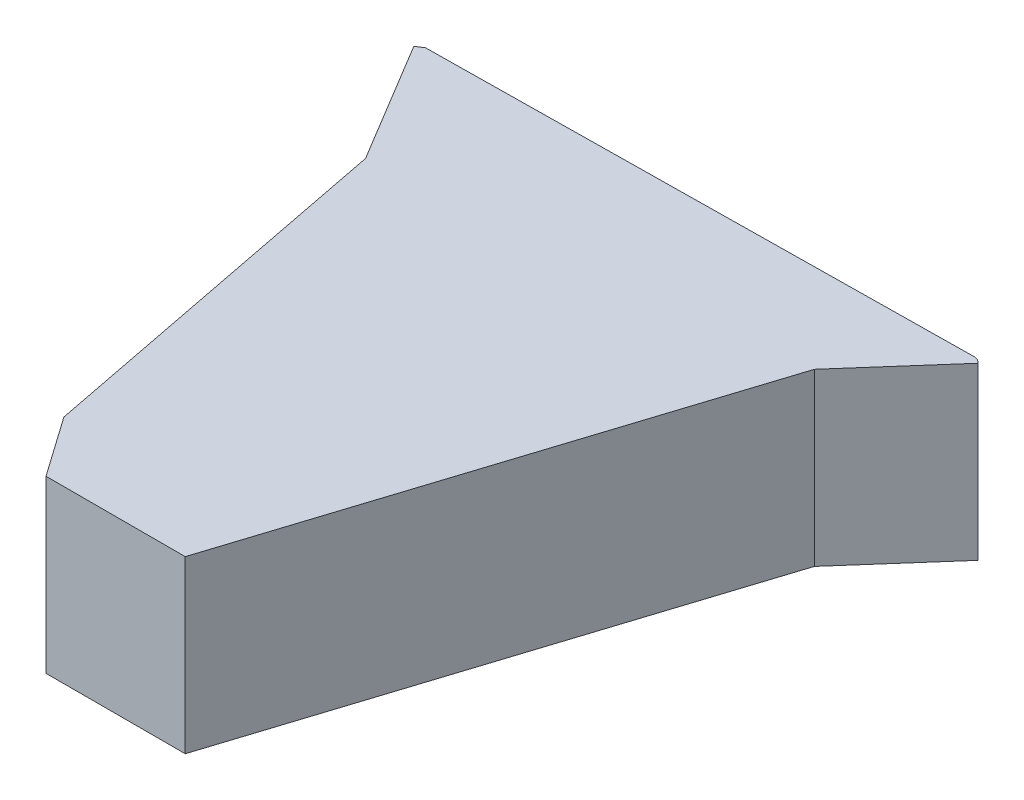
ISO-10303-21;
HEADER;
FILE_DESCRIPTION(('STEP AP214'),'2;1');
FILE_NAME('part.step','',(''),(''),'','','');
FILE_SCHEMA(('AUTOMOTIVE_DESIGN { 1 0 10303 214 1 1 1 1 }'));
ENDSEC;
DATA;
#1=APPLICATION_CONTEXT('core data for automotive mechanical design processes');
#2=APPLICATION_PROTOCOL_DEFINITION('international standard','automotive_design',2000,#1);
#3=PRODUCT_CONTEXT('',#1,'mechanical');
#4=PRODUCT('Part','Part','',(#3));
#5=PRODUCT_RELATED_PRODUCT_CATEGORY('part','',(#4));
#6=PRODUCT_DEFINITION_FORMATION('','',#4);
#7=PRODUCT_DEFINITION_CONTEXT('part definition',#1,'design');
#8=PRODUCT_DEFINITION('design','',#6,#7);
#9=PRODUCT_DEFINITION_SHAPE('','',#8);
#10=(LENGTH_UNIT() NAMED_UNIT(*) SI_UNIT(.MILLI.,.METRE.));
#11=(NAMED_UNIT(*) PLANE_ANGLE_UNIT() SI_UNIT($,.RADIAN.));
#12=(NAMED_UNIT(*) SI_UNIT($,.STERADIAN.) SOLID_ANGLE_UNIT());
#13=UNCERTAINTY_MEASURE_WITH_UNIT(LENGTH_MEASURE(1.E-05),#10,'distance_accuracy_value','');
#14=(GEOMETRIC_REPRESENTATION_CONTEXT(3) GLOBAL_UNCERTAINTY_ASSIGNED_CONTEXT((#13)) GLOBAL_UNIT_ASSIGNED_CONTEXT((#10,
#11,#12)) REPRESENTATION_CONTEXT('',''));
#15=CARTESIAN_POINT('',(0.,0.,0.));
#16=DIRECTION('',(0.,0.,1.));
#17=DIRECTION('',(1.,0.,0.));
#18=AXIS2_PLACEMENT_3D('',#15,#16,#17);
#19=CARTESIAN_POINT('',(0.,80.,0.));
#20=DIRECTION('',(0.,1.,0.));
#21=DIRECTION('',(0.,0.,1.));
#22=AXIS2_PLACEMENT_3D('',#19,#20,#21);
#23=PLANE('',#22);
#24=DIRECTION('',(-0.660248700533118,0.,0.751047038103692));
#25=VECTOR('',#24,1.);
#26=CARTESIAN_POINT('',(46.6502368151546,80.,-274.975459977963));
#27=LINE('',#26,#25);
#28=CARTESIAN_POINT('',(83.7031156426736,80.,-317.123903245104));
#29=VERTEX_POINT('',#28);
#30=CARTESIAN_POINT('',(46.6502368151546,80.,-274.975459977963));
#31=VERTEX_POINT('',#30);
#32=EDGE_CURVE('E234',#29,#31,#27,.T.);
#33=ORIENTED_EDGE('',*,*,#32,.T.);
#34=DIRECTION('',(-0.304316684641277,0.,0.952570918855358));
#35=VECTOR('',#34,1.);
#36=CARTESIAN_POINT('',(-26.188648694374,80.,-46.9754599779608));
#37=LINE('',#36,#35);
#38=CARTESIAN_POINT('',(-26.188648694374,80.,-46.9754599779608));
#39=VERTEX_POINT('',#38);
#40=EDGE_CURVE('E237',#31,#39,#37,.T.);
#41=ORIENTED_EDGE('',*,*,#40,.T.);
#42=DIRECTION('',(-1.,0.,0.));
#43=VECTOR('',#42,1.);
#44=CARTESIAN_POINT('',(-26.188648694374,80.,-46.9754599779608));
#45=LINE('',#44,#43);
#46=CARTESIAN_POINT('',(-90.5581250943112,80.,-46.9754599779625));
#47=VERTEX_POINT('',#46);
#48=EDGE_CURVE('E241',#39,#47,#45,.T.);
#49=ORIENTED_EDGE('',*,*,#48,.T.);
#50=DIRECTION('',(-0.574979090419619,0.,-0.818168103497214));
#51=VECTOR('',#50,1.);
#52=CARTESIAN_POINT('',(-110.045954214974,80.,-74.7057208841369));
#53=LINE('',#52,#51);
#54=CARTESIAN_POINT('',(-110.045954214974,80.,-74.7057208841369));
#55=VERTEX_POINT('',#54);
#56=EDGE_CURVE('E244',#47,#55,#53,.T.);
#57=ORIENTED_EDGE('',*,*,#56,.T.);
#58=DIRECTION('',(-0.191458843739684,0.,-0.981500642462277));
#59=VECTOR('',#58,1.);
#60=CARTESIAN_POINT('',(-110.045954214974,80.,-74.7057208841369));
#61=LINE('',#60,#59);
#62=CARTESIAN_POINT('',(-145.137395051597,80.,-254.599587645919));
#63=VERTEX_POINT('',#62);
#64=EDGE_CURVE('E247',#55,#63,#61,.T.);
#65=ORIENTED_EDGE('',*,*,#64,.T.);
#66=DIRECTION('',(-0.515605453055569,0.,-0.856826129841616));
#67=VECTOR('',#66,1.);
#68=CARTESIAN_POINT('',(-180.407965552068,80.,-313.211742036706));
#69=LINE('',#68,#67);
#70=CARTESIAN_POINT('',(-180.407965552068,80.,-313.211742036706));
#71=VERTEX_POINT('',#70);
#72=EDGE_CURVE('E250',#63,#71,#69,.T.);
#73=ORIENTED_EDGE('',*,*,#72,.T.);
#74=DIRECTION('',(-0.830644318798817,0.,0.556803390477509));
#75=VECTOR('',#74,1.);
#76=CARTESIAN_POINT('',(-180.407965552068,80.,-313.211742036706));
#77=LINE('',#76,#75);
#78=CARTESIAN_POINT('',(-178.74667691447,80.,-314.325348817661));
#79=VERTEX_POINT('',#78);
#80=EDGE_CURVE('E307',#79,#71,#77,.T.);
#81=ORIENTED_EDGE('',*,*,#80,.F.);
#82=DIRECTION('',(-0.999920335389979,0.,0.0126223164906736));
#83=VECTOR('',#82,1.);
#84=CARTESIAN_POINT('',(-178.74667691447,80.,-314.325348817661));
#85=LINE('',#84,#83);
#86=CARTESIAN_POINT('',(81.7640584939281,80.,-317.613859747144));
#87=VERTEX_POINT('',#86);
#88=EDGE_CURVE('E312',#87,#79,#85,.T.);
#89=ORIENTED_EDGE('',*,*,#88,.F.);
#90=DIRECTION('',(-0.969528574373599,0.,-0.244978251020569));
#91=VECTOR('',#90,1.);
#92=CARTESIAN_POINT('',(81.7640584939281,80.,-317.613859747144));
#93=LINE('',#92,#91);
#94=EDGE_CURVE('E335',#29,#87,#93,.T.);
#95=ORIENTED_EDGE('',*,*,#94,.F.);
#96=EDGE_LOOP('',(#33,#41,#49,#57,#65,#73,#81,#89,#95));
#97=FACE_BOUND('',#96,.T.);
#98=CARTESIAN_POINT('',(-100.003600919709,80.,-94.2573460686679));
#99=DIRECTION('',(0.,1.,0.));
#100=DIRECTION('',(0.,0.,1.));
#101=AXIS2_PLACEMENT_3D('',#98,#99,#100);
#102=CIRCLE('',#101,8.99999999999999);
#103=CARTESIAN_POINT('',(-100.003600919709,80.,-85.2573460686679));
#104=VERTEX_POINT('',#103);
#105=EDGE_CURVE('E11',#104,#104,#102,.T.);
#106=ORIENTED_EDGE('',*,*,#105,.T.);
#107=EDGE_LOOP('',(#106));
#108=FACE_BOUND('',#107,.T.);
#109=DIRECTION('',(-0.866025403784438,0.,-0.5));
#110=VECTOR('',#109,1.);
#111=CARTESIAN_POINT('',(-11.059034150561,80.,-169.98673388868));
#112=LINE('',#111,#110);
#113=CARTESIAN_POINT('',(-11.059034150561,80.,-169.98673388868));
#114=VERTEX_POINT('',#113);
#115=CARTESIAN_POINT('',(-51.6700330731528,80.,-193.433505048698));
#116=VERTEX_POINT('',#115);
#117=EDGE_CURVE('E48',#114,#116,#112,.T.);
#118=ORIENTED_EDGE('',*,*,#117,.T.);
#119=DIRECTION('',(-0.866025403784439,0.,0.5));
#120=VECTOR('',#119,1.);
#121=CARTESIAN_POINT('',(-51.6700330731528,80.,-193.433505048698));
#122=LINE('',#121,#120);
#123=CARTESIAN_POINT('',(-92.2810319957446,80.,-169.98673388868));
#124=VERTEX_POINT('',#123);
#125=EDGE_CURVE('E52',#116,#124,#122,.T.);
#126=ORIENTED_EDGE('',*,*,#125,.T.);
#127=DIRECTION('',(0.,0.,1.));
#128=VECTOR('',#127,1.);
#129=CARTESIAN_POINT('',(-92.2810319957446,80.,-169.98673388868));
#130=LINE('',#129,#128);
#131=CARTESIAN_POINT('',(-92.2810319957446,80.,-123.093191568644));
#132=VERTEX_POINT('',#131);
#133=EDGE_CURVE('E677',#124,#132,#130,.T.);
#134=ORIENTED_EDGE('',*,*,#133,.T.);
#135=DIRECTION('',(0.866025403784439,0.,0.5));
#136=VECTOR('',#135,1.);
#137=CARTESIAN_POINT('',(-92.2810319957446,80.,-123.093191568644));
#138=LINE('',#137,#136);
#139=CARTESIAN_POINT('',(-51.6700330731528,80.,-99.6464204086263));
#140=VERTEX_POINT('',#139);
#141=EDGE_CURVE('E190',#132,#140,#138,.T.);
#142=ORIENTED_EDGE('',*,*,#141,.T.);
#143=DIRECTION('',(0.866025403784438,0.,-0.5));
#144=VECTOR('',#143,1.);
#145=CARTESIAN_POINT('',(-51.6700330731528,80.,-99.6464204086263));
#146=LINE('',#145,#144);
#147=CARTESIAN_POINT('',(-11.059034150561,80.,-123.093191568644));
#148=VERTEX_POINT('',#147);
#149=EDGE_CURVE('E184',#140,#148,#146,.T.);
#150=ORIENTED_EDGE('',*,*,#149,.T.);
#151=DIRECTION('',(0.,0.,-1.));
#152=VECTOR('',#151,1.);
#153=CARTESIAN_POINT('',(-11.059034150561,80.,-123.093191568644));
#154=LINE('',#153,#152);
#155=EDGE_CURVE('E187',#148,#114,#154,.T.);
#156=ORIENTED_EDGE('',*,*,#155,.T.);
#157=EDGE_LOOP('',(#118,#126,#134,#142,#150,#156));
#158=FACE_BOUND('',#157,.T.);
#159=ADVANCED_FACE('F33',(#97,#108,#158),#23,.F.);
#160=CARTESIAN_POINT('',(-100.003600919709,80.,-94.2573460686679));
#161=DIRECTION('',(0.,-1.,0.));
#162=DIRECTION('',(0.,0.,-1.));
#163=AXIS2_PLACEMENT_3D('',#160,#161,#162);
#164=CYLINDRICAL_SURFACE('',#163,8.99999999999999);
#165=ORIENTED_EDGE('',*,*,#105,.F.);
#166=EDGE_LOOP('',(#165));
#167=FACE_BOUND('',#166,.T.);
#168=CARTESIAN_POINT('',(-100.003600919709,0.,-94.2573460686679));
#169=DIRECTION('',(0.,1.,0.));
#170=DIRECTION('',(0.,0.,1.));
#171=AXIS2_PLACEMENT_3D('',#168,#169,#170);
#172=CIRCLE('',#171,8.99999999999999);
#173=CARTESIAN_POINT('',(-100.003600919709,0.,-85.2573460686679));
#174=VERTEX_POINT('',#173);
#175=EDGE_CURVE('E37',#174,#174,#172,.T.);
#176=ORIENTED_EDGE('',*,*,#175,.T.);
#177=EDGE_LOOP('',(#176));
#178=FACE_BOUND('',#177,.T.);
#179=ADVANCED_FACE('F35',(#167,#178),#164,.T.);
#180=CARTESIAN_POINT('',(-100.003600919709,0.,-94.2573460686679));
#181=DIRECTION('',(0.,1.,0.));
#182=DIRECTION('',(0.,0.,1.));
#183=AXIS2_PLACEMENT_3D('',#180,#181,#182);
#184=PLANE('',#183);
#185=ORIENTED_EDGE('',*,*,#175,.F.);
#186=EDGE_LOOP('',(#185));
#187=FACE_BOUND('',#186,.T.);
#188=ADVANCED_FACE('F368',(#187),#184,.F.);
#189=CARTESIAN_POINT('',(-180.407965552068,82.,-313.211742036706));
#190=DIRECTION('',(0.556803390477509,0.,0.830644318798817));
#191=DIRECTION('',(0.830644318798817,0.,-0.556803390477509));
#192=AXIS2_PLACEMENT_3D('',#189,#190,#191);
#193=PLANE('',#192);
#194=ORIENTED_EDGE('',*,*,#80,.T.);
#195=DIRECTION('',(0.,-1.,0.));
#196=VECTOR('',#195,1.);
#197=CARTESIAN_POINT('',(-180.407965552068,82.,-313.211742036706));
#198=LINE('',#197,#196);
#199=CARTESIAN_POINT('',(-180.407965552068,82.,-313.211742036706));
#200=VERTEX_POINT('',#199);
#201=EDGE_CURVE('E360',#200,#71,#198,.T.);
#202=ORIENTED_EDGE('',*,*,#201,.F.);
#203=DIRECTION('',(-0.830644318798817,0.,0.556803390477509));
#204=VECTOR('',#203,1.);
#205=CARTESIAN_POINT('',(-180.407965552068,82.,-313.211742036706));
#206=LINE('',#205,#204);
#207=CARTESIAN_POINT('',(-178.74667691447,82.,-314.325348817661));
#208=VERTEX_POINT('',#207);
#209=EDGE_CURVE('E308',#208,#200,#206,.T.);
#210=ORIENTED_EDGE('',*,*,#209,.F.);
#211=DIRECTION('',(0.,-1.,0.));
#212=VECTOR('',#211,1.);
#213=CARTESIAN_POINT('',(-178.74667691447,82.,-314.325348817661));
#214=LINE('',#213,#212);
#215=EDGE_CURVE('E332',#208,#79,#214,.T.);
#216=ORIENTED_EDGE('',*,*,#215,.T.);
#217=EDGE_LOOP('',(#194,#202,#210,#216));
#218=FACE_BOUND('',#217,.T.);
#219=ADVANCED_FACE('F370',(#218),#193,.F.);
#220=CARTESIAN_POINT('',(-180.407965552068,82.,-313.211742036706));
#221=DIRECTION('',(0.515605453055568,0.,0.856826129841616));
#222=DIRECTION('',(0.856826129841616,0.,-0.515605453055568));
#223=AXIS2_PLACEMENT_3D('',#220,#221,#222);
#224=PLANE('',#223);
#225=ORIENTED_EDGE('',*,*,#201,.T.);
#226=DIRECTION('',(0.,-1.,0.));
#227=VECTOR('',#226,1.);
#228=CARTESIAN_POINT('',(-180.407965552068,80.,-313.211742036706));
#229=LINE('',#228,#227);
#230=CARTESIAN_POINT('',(-180.407965552068,0.,-313.211742036706));
#231=VERTEX_POINT('',#230);
#232=EDGE_CURVE('E253',#71,#231,#229,.T.);
#233=ORIENTED_EDGE('',*,*,#232,.T.);
#234=DIRECTION('',(-0.856826129841616,0.,0.515605453055568));
#235=VECTOR('',#234,1.);
#236=CARTESIAN_POINT('',(-182.121617811751,0.,-312.180531130594));
#237=LINE('',#236,#235);
#238=CARTESIAN_POINT('',(-182.121617811751,0.,-312.180531130594));
#239=VERTEX_POINT('',#238);
#240=EDGE_CURVE('E233',#231,#239,#237,.T.);
#241=ORIENTED_EDGE('',*,*,#240,.T.);
#242=DIRECTION('',(0.,-1.,0.));
#243=VECTOR('',#242,1.);
#244=CARTESIAN_POINT('',(-182.121617811751,82.,-312.180531130594));
#245=LINE('',#244,#243);
#246=CARTESIAN_POINT('',(-182.121617811751,82.,-312.180531130594));
#247=VERTEX_POINT('',#246);
#248=EDGE_CURVE('E358',#247,#239,#245,.T.);
#249=ORIENTED_EDGE('',*,*,#248,.F.);
#250=DIRECTION('',(-0.856826129841616,0.,0.515605453055568));
#251=VECTOR('',#250,1.);
#252=CARTESIAN_POINT('',(-180.407965552068,82.,-313.211742036706));
#253=LINE('',#252,#251);
#254=EDGE_CURVE('E311',#200,#247,#253,.T.);
#255=ORIENTED_EDGE('',*,*,#254,.F.);
#256=EDGE_LOOP('',(#225,#233,#241,#249,#255));
#257=FACE_BOUND('',#256,.T.);
#258=ADVANCED_FACE('F375',(#257),#224,.F.);
#259=CARTESIAN_POINT('',(-182.121617811751,82.,-312.180531130594));
#260=DIRECTION('',(0.856826129841616,0.,-0.515605453055569));
#261=DIRECTION('',(-0.515605453055569,0.,-0.856826129841616));
#262=AXIS2_PLACEMENT_3D('',#259,#260,#261);
#263=PLANE('',#262);
#264=ORIENTED_EDGE('',*,*,#248,.T.);
#265=DIRECTION('',(0.515605453055569,0.,0.856826129841616));
#266=VECTOR('',#265,1.);
#267=CARTESIAN_POINT('',(-147.032877616828,0.,-253.870539868742));
#268=LINE('',#267,#266);
#269=CARTESIAN_POINT('',(-147.032877616828,0.,-253.870539868742));
#270=VERTEX_POINT('',#269);
#271=EDGE_CURVE('E256',#239,#270,#268,.T.);
#272=ORIENTED_EDGE('',*,*,#271,.T.);
#273=DIRECTION('',(0.,-1.,0.));
#274=VECTOR('',#273,1.);
#275=CARTESIAN_POINT('',(-147.032877616828,82.,-253.870539868742));
#276=LINE('',#275,#274);
#277=CARTESIAN_POINT('',(-147.032877616828,82.,-253.870539868742));
#278=VERTEX_POINT('',#277);
#279=EDGE_CURVE('E356',#278,#270,#276,.T.);
#280=ORIENTED_EDGE('',*,*,#279,.F.);
#281=DIRECTION('',(0.515605453055569,0.,0.856826129841616));
#282=VECTOR('',#281,1.);
#283=CARTESIAN_POINT('',(-182.121617811751,82.,-312.180531130594));
#284=LINE('',#283,#282);
#285=EDGE_CURVE('E314',#247,#278,#284,.T.);
#286=ORIENTED_EDGE('',*,*,#285,.F.);
#287=EDGE_LOOP('',(#264,#272,#280,#286));
#288=FACE_BOUND('',#287,.T.);
#289=ADVANCED_FACE('F420',(#288),#263,.F.);
#290=CARTESIAN_POINT('',(-147.032877616828,82.,-253.870539868742));
#291=DIRECTION('',(0.981500642462277,0.,-0.191458843739684));
#292=DIRECTION('',(-0.191458843739684,0.,-0.981500642462278));
#293=AXIS2_PLACEMENT_3D('',#290,#291,#292);
#294=PLANE('',#293);
#295=ORIENTED_EDGE('',*,*,#279,.T.);
#296=DIRECTION('',(0.191458843739684,0.,0.981500642462277));
#297=VECTOR('',#296,1.);
#298=CARTESIAN_POINT('',(-147.032877616828,0.,-253.870539868742));
#299=LINE('',#298,#297);
#300=CARTESIAN_POINT('',(-111.927353434914,0.,-73.9044758023983));
#301=VERTEX_POINT('',#300);
#302=EDGE_CURVE('E259',#270,#301,#299,.T.);
#303=ORIENTED_EDGE('',*,*,#302,.T.);
#304=DIRECTION('',(0.,-1.,0.));
#305=VECTOR('',#304,1.);
#306=CARTESIAN_POINT('',(-111.927353434914,82.,-73.9044758023983));
#307=LINE('',#306,#305);
#308=CARTESIAN_POINT('',(-111.927353434914,82.,-73.9044758023983));
#309=VERTEX_POINT('',#308);
#310=EDGE_CURVE('E354',#309,#301,#307,.T.);
#311=ORIENTED_EDGE('',*,*,#310,.F.);
#312=DIRECTION('',(0.191458843739684,0.,0.981500642462277));
#313=VECTOR('',#312,1.);
#314=CARTESIAN_POINT('',(-147.032877616828,82.,-253.870539868742));
#315=LINE('',#314,#313);
#316=EDGE_CURVE('E316',#278,#309,#315,.T.);
#317=ORIENTED_EDGE('',*,*,#316,.F.);
#318=EDGE_LOOP('',(#295,#303,#311,#317));
#319=FACE_BOUND('',#318,.T.);
#320=ADVANCED_FACE('F416',(#319),#294,.F.);
#321=CARTESIAN_POINT('',(-91.5970825109194,82.,-44.9754599779625));
#322=DIRECTION('',(0.818168103497214,0.,-0.574979090419619));
#323=DIRECTION('',(-0.574979090419619,0.,-0.818168103497214));
#324=AXIS2_PLACEMENT_3D('',#321,#322,#323);
#325=PLANE('',#324);
#326=ORIENTED_EDGE('',*,*,#310,.T.);
#327=DIRECTION('',(0.574979090419619,0.,0.818168103497213));
#328=VECTOR('',#327,1.);
#329=CARTESIAN_POINT('',(-111.927353434914,0.,-73.9044758023983));
#330=LINE('',#329,#328);
#331=CARTESIAN_POINT('',(-91.5970825109194,0.,-44.9754599779625));
#332=VERTEX_POINT('',#331);
#333=EDGE_CURVE('E262',#301,#332,#330,.T.);
#334=ORIENTED_EDGE('',*,*,#333,.T.);
#335=DIRECTION('',(0.,-1.,0.));
#336=VECTOR('',#335,1.);
#337=CARTESIAN_POINT('',(-91.5970825109194,82.,-44.9754599779625));
#338=LINE('',#337,#336);
#339=CARTESIAN_POINT('',(-91.5970825109194,82.,-44.9754599779625));
#340=VERTEX_POINT('',#339);
#341=EDGE_CURVE('E352',#340,#332,#338,.T.);
#342=ORIENTED_EDGE('',*,*,#341,.F.);
#343=DIRECTION('',(0.574979090419619,0.,0.818168103497213));
#344=VECTOR('',#343,1.);
#345=CARTESIAN_POINT('',(-91.5970825109194,82.,-44.9754599779625));
#346=LINE('',#345,#344);
#347=EDGE_CURVE('E318',#309,#340,#346,.T.);
#348=ORIENTED_EDGE('',*,*,#347,.F.);
#349=EDGE_LOOP('',(#326,#334,#342,#348));
#350=FACE_BOUND('',#349,.T.);
#351=ADVANCED_FACE('F412',(#350),#325,.F.);
#352=CARTESIAN_POINT('',(-91.5970825109194,82.,-44.9754599779625));
#353=DIRECTION('',(0.,0.,-1.));
#354=DIRECTION('',(-1.,0.,0.));
#355=AXIS2_PLACEMENT_3D('',#352,#353,#354);
#356=PLANE('',#355);
#357=ORIENTED_EDGE('',*,*,#341,.T.);
#358=DIRECTION('',(1.,0.,0.));
#359=VECTOR('',#358,1.);
#360=CARTESIAN_POINT('',(-91.5970825109194,0.,-44.9754599779625));
#361=LINE('',#360,#359);
#362=CARTESIAN_POINT('',(-24.7280050791047,0.,-44.9754599779607));
#363=VERTEX_POINT('',#362);
#364=EDGE_CURVE('E265',#332,#363,#361,.T.);
#365=ORIENTED_EDGE('',*,*,#364,.T.);
#366=DIRECTION('',(0.,-1.,0.));
#367=VECTOR('',#366,1.);
#368=CARTESIAN_POINT('',(-24.7280050791047,82.,-44.9754599779607));
#369=LINE('',#368,#367);
#370=CARTESIAN_POINT('',(-24.7280050791047,82.,-44.9754599779607));
#371=VERTEX_POINT('',#370);
#372=EDGE_CURVE('E350',#371,#363,#369,.T.);
#373=ORIENTED_EDGE('',*,*,#372,.F.);
#374=DIRECTION('',(1.,0.,0.));
#375=VECTOR('',#374,1.);
#376=CARTESIAN_POINT('',(-91.5970825109194,82.,-44.9754599779625));
#377=LINE('',#376,#375);
#378=EDGE_CURVE('E320',#340,#371,#377,.T.);
#379=ORIENTED_EDGE('',*,*,#378,.F.);
#380=EDGE_LOOP('',(#357,#365,#373,#379));
#381=FACE_BOUND('',#380,.T.);
#382=ADVANCED_FACE('F408',(#381),#356,.F.);
#383=CARTESIAN_POINT('',(-24.7280050791047,82.,-44.9754599779607));
#384=DIRECTION('',(-0.952570918855358,0.,-0.304316684641277));
#385=DIRECTION('',(-0.304316684641277,0.,0.952570918855358));
#386=AXIS2_PLACEMENT_3D('',#383,#384,#385);
#387=PLANE('',#386);
#388=ORIENTED_EDGE('',*,*,#372,.T.);
#389=DIRECTION('',(0.304316684641277,0.,-0.952570918855358));
#390=VECTOR('',#389,1.);
#391=CARTESIAN_POINT('',(48.4282186278252,0.,-273.968790786107));
#392=LINE('',#391,#390);
#393=CARTESIAN_POINT('',(48.4282186278252,0.,-273.968790786107));
#394=VERTEX_POINT('',#393);
#395=EDGE_CURVE('E268',#363,#394,#392,.T.);
#396=ORIENTED_EDGE('',*,*,#395,.T.);
#397=DIRECTION('',(0.,-1.,0.));
#398=VECTOR('',#397,1.);
#399=CARTESIAN_POINT('',(48.4282186278252,82.,-273.968790786107));
#400=LINE('',#399,#398);
#401=CARTESIAN_POINT('',(48.4282186278252,82.,-273.968790786107));
#402=VERTEX_POINT('',#401);
#403=EDGE_CURVE('E348',#402,#394,#400,.T.);
#404=ORIENTED_EDGE('',*,*,#403,.F.);
#405=DIRECTION('',(0.304316684641277,0.,-0.952570918855358));
#406=VECTOR('',#405,1.);
#407=CARTESIAN_POINT('',(-24.7280050791047,82.,-44.9754599779607));
#408=LINE('',#407,#406);
#409=EDGE_CURVE('E322',#371,#402,#408,.T.);
#410=ORIENTED_EDGE('',*,*,#409,.F.);
#411=EDGE_LOOP('',(#388,#396,#404,#410));
#412=FACE_BOUND('',#411,.T.);
#413=ADVANCED_FACE('F404',(#412),#387,.F.);
#414=CARTESIAN_POINT('',(48.4282186278252,82.,-273.968790786107));
#415=DIRECTION('',(-0.751047038103692,0.,-0.660248700533119));
#416=DIRECTION('',(-0.660248700533119,0.,0.751047038103692));
#417=AXIS2_PLACEMENT_3D('',#414,#415,#416);
#418=PLANE('',#417);
#419=ORIENTED_EDGE('',*,*,#403,.T.);
#420=DIRECTION('',(0.660248700533119,0.,-0.751047038103692));
#421=VECTOR('',#420,1.);
#422=CARTESIAN_POINT('',(85.2052097188798,0.,-315.803405844038));
#423=LINE('',#422,#421);
#424=CARTESIAN_POINT('',(85.2052097188798,0.,-315.803405844038));
#425=VERTEX_POINT('',#424);
#426=EDGE_CURVE('E271',#394,#425,#423,.T.);
#427=ORIENTED_EDGE('',*,*,#426,.T.);
#428=DIRECTION('',(0.,-1.,0.));
#429=VECTOR('',#428,1.);
#430=CARTESIAN_POINT('',(85.2052097188798,82.,-315.803405844038));
#431=LINE('',#430,#429);
#432=CARTESIAN_POINT('',(85.2052097188798,82.,-315.803405844038));
#433=VERTEX_POINT('',#432);
#434=EDGE_CURVE('E346',#433,#425,#431,.T.);
#435=ORIENTED_EDGE('',*,*,#434,.F.);
#436=DIRECTION('',(0.660248700533119,0.,-0.751047038103692));
#437=VECTOR('',#436,1.);
#438=CARTESIAN_POINT('',(48.4282186278252,82.,-273.968790786107));
#439=LINE('',#438,#437);
#440=EDGE_CURVE('E324',#402,#433,#439,.T.);
#441=ORIENTED_EDGE('',*,*,#440,.F.);
#442=EDGE_LOOP('',(#419,#427,#435,#441));
#443=FACE_BOUND('',#442,.T.);
#444=ADVANCED_FACE('F400',(#443),#418,.F.);
#445=CARTESIAN_POINT('',(85.2052097188798,82.,-315.803405844038));
#446=DIRECTION('',(-0.660248700533117,0.,0.751047038103693));
#447=DIRECTION('',(0.751047038103693,0.,0.660248700533117));
#448=AXIS2_PLACEMENT_3D('',#445,#446,#447);
#449=PLANE('',#448);
#450=ORIENTED_EDGE('',*,*,#434,.T.);
#451=DIRECTION('',(-0.751047038103693,0.,-0.660248700533117));
#452=VECTOR('',#451,1.);
#453=CARTESIAN_POINT('',(83.7031156426736,0.,-317.123903245104));
#454=LINE('',#453,#452);
#455=CARTESIAN_POINT('',(83.7031156426736,0.,-317.123903245104));
#456=VERTEX_POINT('',#455);
#457=EDGE_CURVE('E274',#425,#456,#454,.T.);
#458=ORIENTED_EDGE('',*,*,#457,.T.);
#459=DIRECTION('',(0.,-1.,0.));
#460=VECTOR('',#459,1.);
#461=CARTESIAN_POINT('',(83.7031156426736,80.,-317.123903245104));
#462=LINE('',#461,#460);
#463=EDGE_CURVE('E304',#29,#456,#462,.T.);
#464=ORIENTED_EDGE('',*,*,#463,.F.);
#465=DIRECTION('',(0.,-1.,0.));
#466=VECTOR('',#465,1.);
#467=CARTESIAN_POINT('',(83.7031156426736,82.,-317.123903245104));
#468=LINE('',#467,#466);
#469=CARTESIAN_POINT('',(83.7031156426736,82.,-317.123903245104));
#470=VERTEX_POINT('',#469);
#471=EDGE_CURVE('E343',#470,#29,#468,.T.);
#472=ORIENTED_EDGE('',*,*,#471,.F.);
#473=DIRECTION('',(-0.751047038103693,0.,-0.660248700533117));
#474=VECTOR('',#473,1.);
#475=CARTESIAN_POINT('',(85.2052097188798,82.,-315.803405844038));
#476=LINE('',#475,#474);
#477=EDGE_CURVE('E326',#433,#470,#476,.T.);
#478=ORIENTED_EDGE('',*,*,#477,.F.);
#479=EDGE_LOOP('',(#450,#458,#464,#472,#478));
#480=FACE_BOUND('',#479,.T.);
#481=ADVANCED_FACE('F396',(#480),#449,.F.);
#482=CARTESIAN_POINT('',(81.7640584939281,82.,-317.613859747144));
#483=DIRECTION('',(-0.244978251020569,0.,0.969528574373599));
#484=DIRECTION('',(0.969528574373599,0.,0.244978251020569));
#485=AXIS2_PLACEMENT_3D('',#482,#483,#484);
#486=PLANE('',#485);
#487=ORIENTED_EDGE('',*,*,#94,.T.);
#488=DIRECTION('',(0.,-1.,0.));
#489=VECTOR('',#488,1.);
#490=CARTESIAN_POINT('',(81.7640584939281,82.,-317.613859747144));
#491=LINE('',#490,#489);
#492=CARTESIAN_POINT('',(81.7640584939281,82.,-317.613859747144));
#493=VERTEX_POINT('',#492);
#494=EDGE_CURVE('E340',#493,#87,#491,.T.);
#495=ORIENTED_EDGE('',*,*,#494,.F.);
#496=DIRECTION('',(-0.969528574373599,0.,-0.244978251020569));
#497=VECTOR('',#496,1.);
#498=CARTESIAN_POINT('',(81.7640584939281,82.,-317.613859747144));
#499=LINE('',#498,#497);
#500=EDGE_CURVE('E328',#470,#493,#499,.T.);
#501=ORIENTED_EDGE('',*,*,#500,.F.);
#502=ORIENTED_EDGE('',*,*,#471,.T.);
#503=EDGE_LOOP('',(#487,#495,#501,#502));
#504=FACE_BOUND('',#503,.T.);
#505=ADVANCED_FACE('F392',(#504),#486,.F.);
#506=CARTESIAN_POINT('',(-178.74667691447,82.,-314.325348817661));
#507=DIRECTION('',(0.0126223164906736,0.,0.99992033538998));
#508=DIRECTION('',(0.99992033538998,0.,-0.0126223164906736));
#509=AXIS2_PLACEMENT_3D('',#506,#507,#508);
#510=PLANE('',#509);
#511=ORIENTED_EDGE('',*,*,#88,.T.);
#512=ORIENTED_EDGE('',*,*,#215,.F.);
#513=DIRECTION('',(-0.999920335389979,0.,0.0126223164906736));
#514=VECTOR('',#513,1.);
#515=CARTESIAN_POINT('',(-178.74667691447,82.,-314.325348817661));
#516=LINE('',#515,#514);
#517=EDGE_CURVE('E330',#493,#208,#516,.T.);
#518=ORIENTED_EDGE('',*,*,#517,.F.);
#519=ORIENTED_EDGE('',*,*,#494,.T.);
#520=EDGE_LOOP('',(#511,#512,#518,#519));
#521=FACE_BOUND('',#520,.T.);
#522=ADVANCED_FACE('F389',(#521),#510,.F.);
#523=CARTESIAN_POINT('',(0.,82.,0.));
#524=DIRECTION('',(0.,1.,0.));
#525=DIRECTION('',(0.,0.,1.));
#526=AXIS2_PLACEMENT_3D('',#523,#524,#525);
#527=PLANE('',#526);
#528=ORIENTED_EDGE('',*,*,#209,.T.);
#529=ORIENTED_EDGE('',*,*,#254,.T.);
#530=ORIENTED_EDGE('',*,*,#285,.T.);
#531=ORIENTED_EDGE('',*,*,#316,.T.);
#532=ORIENTED_EDGE('',*,*,#347,.T.);
#533=ORIENTED_EDGE('',*,*,#378,.T.);
#534=ORIENTED_EDGE('',*,*,#409,.T.);
#535=ORIENTED_EDGE('',*,*,#440,.T.);
#536=ORIENTED_EDGE('',*,*,#477,.T.);
#537=ORIENTED_EDGE('',*,*,#500,.T.);
#538=ORIENTED_EDGE('',*,*,#517,.T.);
#539=EDGE_LOOP('',(#528,#529,#530,#531,#532,#533,#534,#535,#536,#537,#538));
#540=FACE_BOUND('',#539,.T.);
#541=ADVANCED_FACE('F387',(#540),#527,.T.);
#542=CARTESIAN_POINT('',(46.6502368151546,80.,-274.975459977963));
#543=DIRECTION('',(0.751047038103692,0.,0.660248700533118));
#544=DIRECTION('',(0.660248700533118,0.,-0.751047038103692));
#545=AXIS2_PLACEMENT_3D('',#542,#543,#544);
#546=PLANE('',#545);
#547=DIRECTION('',(-0.660248700533118,0.,0.751047038103692));
#548=VECTOR('',#547,1.);
#549=CARTESIAN_POINT('',(46.6502368151546,0.,-274.975459977963));
#550=LINE('',#549,#548);
#551=CARTESIAN_POINT('',(46.6502368151546,0.,-274.975459977963));
#552=VERTEX_POINT('',#551);
#553=EDGE_CURVE('E276',#456,#552,#550,.T.);
#554=ORIENTED_EDGE('',*,*,#553,.T.);
#555=DIRECTION('',(0.,-1.,0.));
#556=VECTOR('',#555,1.);
#557=CARTESIAN_POINT('',(46.6502368151546,80.,-274.975459977963));
#558=LINE('',#557,#556);
#559=EDGE_CURVE('E301',#31,#552,#558,.T.);
#560=ORIENTED_EDGE('',*,*,#559,.F.);
#561=ORIENTED_EDGE('',*,*,#32,.F.);
#562=ORIENTED_EDGE('',*,*,#463,.T.);
#563=EDGE_LOOP('',(#554,#560,#561,#562));
#564=FACE_BOUND('',#563,.T.);
#565=ADVANCED_FACE('F472',(#564),#546,.F.);
#566=CARTESIAN_POINT('',(-26.188648694374,80.,-46.9754599779608));
#567=DIRECTION('',(0.952570918855358,0.,0.304316684641277));
#568=DIRECTION('',(0.304316684641277,0.,-0.952570918855358));
#569=AXIS2_PLACEMENT_3D('',#566,#567,#568);
#570=PLANE('',#569);
#571=DIRECTION('',(-0.304316684641277,0.,0.952570918855358));
#572=VECTOR('',#571,1.);
#573=CARTESIAN_POINT('',(-26.188648694374,0.,-46.9754599779608));
#574=LINE('',#573,#572);
#575=CARTESIAN_POINT('',(-26.188648694374,0.,-46.9754599779608));
#576=VERTEX_POINT('',#575);
#577=EDGE_CURVE('E278',#552,#576,#574,.T.);
#578=ORIENTED_EDGE('',*,*,#577,.T.);
#579=DIRECTION('',(0.,-1.,0.));
#580=VECTOR('',#579,1.);
#581=CARTESIAN_POINT('',(-26.188648694374,80.,-46.9754599779608));
#582=LINE('',#581,#580);
#583=EDGE_CURVE('E298',#39,#576,#582,.T.);
#584=ORIENTED_EDGE('',*,*,#583,.F.);
#585=ORIENTED_EDGE('',*,*,#40,.F.);
#586=ORIENTED_EDGE('',*,*,#559,.T.);
#587=EDGE_LOOP('',(#578,#584,#585,#586));
#588=FACE_BOUND('',#587,.T.);
#589=ADVANCED_FACE('F479',(#588),#570,.F.);
#590=CARTESIAN_POINT('',(-26.188648694374,80.,-46.9754599779608));
#591=DIRECTION('',(0.,0.,1.));
#592=DIRECTION('',(1.,0.,0.));
#593=AXIS2_PLACEMENT_3D('',#590,#591,#592);
#594=PLANE('',#593);
#595=DIRECTION('',(-1.,0.,0.));
#596=VECTOR('',#595,1.);
#597=CARTESIAN_POINT('',(-26.188648694374,0.,-46.9754599779608));
#598=LINE('',#597,#596);
#599=CARTESIAN_POINT('',(-90.5581250943112,0.,-46.9754599779625));
#600=VERTEX_POINT('',#599);
#601=EDGE_CURVE('E280',#576,#600,#598,.T.);
#602=ORIENTED_EDGE('',*,*,#601,.T.);
#603=DIRECTION('',(0.,-1.,0.));
#604=VECTOR('',#603,1.);
#605=CARTESIAN_POINT('',(-90.5581250943112,80.,-46.9754599779625));
#606=LINE('',#605,#604);
#607=EDGE_CURVE('E295',#47,#600,#606,.T.);
#608=ORIENTED_EDGE('',*,*,#607,.F.);
#609=ORIENTED_EDGE('',*,*,#48,.F.);
#610=ORIENTED_EDGE('',*,*,#583,.T.);
#611=EDGE_LOOP('',(#602,#608,#609,#610));
#612=FACE_BOUND('',#611,.T.);
#613=ADVANCED_FACE('F486',(#612),#594,.F.);
#614=CARTESIAN_POINT('',(-110.045954214974,80.,-74.7057208841369));
#615=DIRECTION('',(-0.818168103497214,0.,0.574979090419619));
#616=DIRECTION('',(0.574979090419619,0.,0.818168103497214));
#617=AXIS2_PLACEMENT_3D('',#614,#615,#616);
#618=PLANE('',#617);
#619=DIRECTION('',(-0.574979090419619,0.,-0.818168103497214));
#620=VECTOR('',#619,1.);
#621=CARTESIAN_POINT('',(-110.045954214974,0.,-74.7057208841369));
#622=LINE('',#621,#620);
#623=CARTESIAN_POINT('',(-110.045954214974,0.,-74.7057208841369));
#624=VERTEX_POINT('',#623);
#625=EDGE_CURVE('E282',#600,#624,#622,.T.);
#626=ORIENTED_EDGE('',*,*,#625,.T.);
#627=DIRECTION('',(0.,-1.,0.));
#628=VECTOR('',#627,1.);
#629=CARTESIAN_POINT('',(-110.045954214974,80.,-74.7057208841369));
#630=LINE('',#629,#628);
#631=EDGE_CURVE('E292',#55,#624,#630,.T.);
#632=ORIENTED_EDGE('',*,*,#631,.F.);
#633=ORIENTED_EDGE('',*,*,#56,.F.);
#634=ORIENTED_EDGE('',*,*,#607,.T.);
#635=EDGE_LOOP('',(#626,#632,#633,#634));
#636=FACE_BOUND('',#635,.T.);
#637=ADVANCED_FACE('F494',(#636),#618,.F.);
#638=CARTESIAN_POINT('',(-110.045954214974,80.,-74.7057208841369));
#639=DIRECTION('',(-0.981500642462277,0.,0.191458843739684));
#640=DIRECTION('',(0.191458843739684,0.,0.981500642462277));
#641=AXIS2_PLACEMENT_3D('',#638,#639,#640);
#642=PLANE('',#641);
#643=DIRECTION('',(-0.191458843739684,0.,-0.981500642462277));
#644=VECTOR('',#643,1.);
#645=CARTESIAN_POINT('',(-110.045954214974,0.,-74.7057208841369));
#646=LINE('',#645,#644);
#647=CARTESIAN_POINT('',(-145.137395051597,0.,-254.599587645919));
#648=VERTEX_POINT('',#647);
#649=EDGE_CURVE('E284',#624,#648,#646,.T.);
#650=ORIENTED_EDGE('',*,*,#649,.T.);
#651=DIRECTION('',(0.,-1.,0.));
#652=VECTOR('',#651,1.);
#653=CARTESIAN_POINT('',(-145.137395051597,80.,-254.599587645919));
#654=LINE('',#653,#652);
#655=EDGE_CURVE('E289',#63,#648,#654,.T.);
#656=ORIENTED_EDGE('',*,*,#655,.F.);
#657=ORIENTED_EDGE('',*,*,#64,.F.);
#658=ORIENTED_EDGE('',*,*,#631,.T.);
#659=EDGE_LOOP('',(#650,#656,#657,#658));
#660=FACE_BOUND('',#659,.T.);
#661=ADVANCED_FACE('F502',(#660),#642,.F.);
#662=CARTESIAN_POINT('',(-180.407965552068,80.,-313.211742036706));
#663=DIRECTION('',(-0.856826129841616,0.,0.515605453055569));
#664=DIRECTION('',(0.515605453055569,0.,0.856826129841616));
#665=AXIS2_PLACEMENT_3D('',#662,#663,#664);
#666=PLANE('',#665);
#667=DIRECTION('',(-0.515605453055569,0.,-0.856826129841616));
#668=VECTOR('',#667,1.);
#669=CARTESIAN_POINT('',(-180.407965552068,0.,-313.211742036706));
#670=LINE('',#669,#668);
#671=EDGE_CURVE('E238',#648,#231,#670,.T.);
#672=ORIENTED_EDGE('',*,*,#671,.T.);
#673=ORIENTED_EDGE('',*,*,#232,.F.);
#674=ORIENTED_EDGE('',*,*,#72,.F.);
#675=ORIENTED_EDGE('',*,*,#655,.T.);
#676=EDGE_LOOP('',(#672,#673,#674,#675));
#677=FACE_BOUND('',#676,.T.);
#678=ADVANCED_FACE('F510',(#677),#666,.F.);
#679=CARTESIAN_POINT('',(0.,0.,0.));
#680=DIRECTION('',(0.,-1.,0.));
#681=DIRECTION('',(0.,0.,-1.));
#682=AXIS2_PLACEMENT_3D('',#679,#680,#681);
#683=PLANE('',#682);
#684=ORIENTED_EDGE('',*,*,#240,.F.);
#685=ORIENTED_EDGE('',*,*,#671,.F.);
#686=ORIENTED_EDGE('',*,*,#649,.F.);
#687=ORIENTED_EDGE('',*,*,#625,.F.);
#688=ORIENTED_EDGE('',*,*,#601,.F.);
#689=ORIENTED_EDGE('',*,*,#577,.F.);
#690=ORIENTED_EDGE('',*,*,#553,.F.);
#691=ORIENTED_EDGE('',*,*,#457,.F.);
#692=ORIENTED_EDGE('',*,*,#426,.F.);
#693=ORIENTED_EDGE('',*,*,#395,.F.);
#694=ORIENTED_EDGE('',*,*,#364,.F.);
#695=ORIENTED_EDGE('',*,*,#333,.F.);
#696=ORIENTED_EDGE('',*,*,#302,.F.);
#697=ORIENTED_EDGE('',*,*,#271,.F.);
#698=EDGE_LOOP('',(#684,#685,#686,#687,#688,#689,#690,#691,#692,#693,#694,#695,#696,#697));
#699=FACE_BOUND('',#698,.T.);
#700=ADVANCED_FACE('F518',(#699),#683,.T.);
#701=CARTESIAN_POINT('',(-11.059034150561,80.,-169.98673388868));
#702=DIRECTION('',(-0.5,0.,0.866025403784439));
#703=DIRECTION('',(0.866025403784439,0.,0.5));
#704=AXIS2_PLACEMENT_3D('',#701,#702,#703);
#705=PLANE('',#704);
#706=DIRECTION('',(-0.866025403784438,0.,-0.5));
#707=VECTOR('',#706,1.);
#708=CARTESIAN_POINT('',(-11.059034150561,0.,-169.98673388868));
#709=LINE('',#708,#707);
#710=CARTESIAN_POINT('',(-11.059034150561,0.,-169.98673388868));
#711=VERTEX_POINT('',#710);
#712=CARTESIAN_POINT('',(-51.6700330731528,0.,-193.433505048698));
#713=VERTEX_POINT('',#712);
#714=EDGE_CURVE('E211',#711,#713,#709,.T.);
#715=ORIENTED_EDGE('',*,*,#714,.T.);
#716=DIRECTION('',(0.,-1.,0.));
#717=VECTOR('',#716,1.);
#718=CARTESIAN_POINT('',(-51.6700330731528,80.,-193.433505048698));
#719=LINE('',#718,#717);
#720=EDGE_CURVE('E230',#116,#713,#719,.T.);
#721=ORIENTED_EDGE('',*,*,#720,.F.);
#722=ORIENTED_EDGE('',*,*,#117,.F.);
#723=DIRECTION('',(0.,-1.,0.));
#724=VECTOR('',#723,1.);
#725=CARTESIAN_POINT('',(-11.059034150561,80.,-169.98673388868));
#726=LINE('',#725,#724);
#727=EDGE_CURVE('E203',#114,#711,#726,.T.);
#728=ORIENTED_EDGE('',*,*,#727,.T.);
#729=EDGE_LOOP('',(#715,#721,#722,#728));
#730=FACE_BOUND('',#729,.T.);
#731=ADVANCED_FACE('F526',(#730),#705,.F.);
#732=CARTESIAN_POINT('',(-51.6700330731528,80.,-193.433505048698));
#733=DIRECTION('',(0.5,0.,0.866025403784439));
#734=DIRECTION('',(0.866025403784439,0.,-0.5));
#735=AXIS2_PLACEMENT_3D('',#732,#733,#734);
#736=PLANE('',#735);
#737=DIRECTION('',(-0.866025403784439,0.,0.5));
#738=VECTOR('',#737,1.);
#739=CARTESIAN_POINT('',(-51.6700330731528,0.,-193.433505048698));
#740=LINE('',#739,#738);
#741=CARTESIAN_POINT('',(-92.2810319957446,0.,-169.98673388868));
#742=VERTEX_POINT('',#741);
#743=EDGE_CURVE('E214',#713,#742,#740,.T.);
#744=ORIENTED_EDGE('',*,*,#743,.T.);
#745=DIRECTION('',(0.,-1.,0.));
#746=VECTOR('',#745,1.);
#747=CARTESIAN_POINT('',(-92.2810319957446,80.,-169.98673388868));
#748=LINE('',#747,#746);
#749=EDGE_CURVE('E227',#124,#742,#748,.T.);
#750=ORIENTED_EDGE('',*,*,#749,.F.);
#751=ORIENTED_EDGE('',*,*,#125,.F.);
#752=ORIENTED_EDGE('',*,*,#720,.T.);
#753=EDGE_LOOP('',(#744,#750,#751,#752));
#754=FACE_BOUND('',#753,.T.);
#755=ADVANCED_FACE('F534',(#754),#736,.F.);
#756=CARTESIAN_POINT('',(-92.2810319957446,80.,-169.98673388868));
#757=DIRECTION('',(1.,0.,0.));
#758=DIRECTION('',(0.,0.,-1.));
#759=AXIS2_PLACEMENT_3D('',#756,#757,#758);
#760=PLANE('',#759);
#761=DIRECTION('',(0.,0.,1.));
#762=VECTOR('',#761,1.);
#763=CARTESIAN_POINT('',(-92.2810319957446,0.,-169.98673388868));
#764=LINE('',#763,#762);
#765=CARTESIAN_POINT('',(-92.2810319957446,0.,-123.093191568644));
#766=VERTEX_POINT('',#765);
#767=EDGE_CURVE('E216',#742,#766,#764,.T.);
#768=ORIENTED_EDGE('',*,*,#767,.T.);
#769=DIRECTION('',(0.,-1.,0.));
#770=VECTOR('',#769,1.);
#771=CARTESIAN_POINT('',(-92.2810319957446,80.,-123.093191568644));
#772=LINE('',#771,#770);
#773=EDGE_CURVE('E224',#132,#766,#772,.T.);
#774=ORIENTED_EDGE('',*,*,#773,.F.);
#775=ORIENTED_EDGE('',*,*,#133,.F.);
#776=ORIENTED_EDGE('',*,*,#749,.T.);
#777=EDGE_LOOP('',(#768,#774,#775,#776));
#778=FACE_BOUND('',#777,.T.);
#779=ADVANCED_FACE('F542',(#778),#760,.F.);
#780=CARTESIAN_POINT('',(-92.2810319957446,80.,-123.093191568644));
#781=DIRECTION('',(0.5,0.,-0.866025403784438));
#782=DIRECTION('',(-0.866025403784439,0.,-0.5));
#783=AXIS2_PLACEMENT_3D('',#780,#781,#782);
#784=PLANE('',#783);
#785=DIRECTION('',(0.866025403784439,0.,0.5));
#786=VECTOR('',#785,1.);
#787=CARTESIAN_POINT('',(-92.2810319957446,0.,-123.093191568644));
#788=LINE('',#787,#786);
#789=CARTESIAN_POINT('',(-51.6700330731528,0.,-99.6464204086263));
#790=VERTEX_POINT('',#789);
#791=EDGE_CURVE('E218',#766,#790,#788,.T.);
#792=ORIENTED_EDGE('',*,*,#791,.T.);
#793=DIRECTION('',(0.,-1.,0.));
#794=VECTOR('',#793,1.);
#795=CARTESIAN_POINT('',(-51.6700330731528,80.,-99.6464204086263));
#796=LINE('',#795,#794);
#797=EDGE_CURVE('E202',#140,#790,#796,.T.);
#798=ORIENTED_EDGE('',*,*,#797,.F.);
#799=ORIENTED_EDGE('',*,*,#141,.F.);
#800=ORIENTED_EDGE('',*,*,#773,.T.);
#801=EDGE_LOOP('',(#792,#798,#799,#800));
#802=FACE_BOUND('',#801,.T.);
#803=ADVANCED_FACE('F550',(#802),#784,.F.);
#804=CARTESIAN_POINT('',(-51.6700330731528,80.,-99.6464204086263));
#805=DIRECTION('',(-0.5,0.,-0.866025403784439));
#806=DIRECTION('',(-0.866025403784439,0.,0.5));
#807=AXIS2_PLACEMENT_3D('',#804,#805,#806);
#808=PLANE('',#807);
#809=DIRECTION('',(0.866025403784438,0.,-0.5));
#810=VECTOR('',#809,1.);
#811=CARTESIAN_POINT('',(-51.6700330731528,0.,-99.6464204086263));
#812=LINE('',#811,#810);
#813=CARTESIAN_POINT('',(-11.059034150561,0.,-123.093191568644));
#814=VERTEX_POINT('',#813);
#815=EDGE_CURVE('E199',#790,#814,#812,.T.);
#816=ORIENTED_EDGE('',*,*,#815,.T.);
#817=DIRECTION('',(0.,-1.,0.));
#818=VECTOR('',#817,1.);
#819=CARTESIAN_POINT('',(-11.059034150561,80.,-123.093191568644));
#820=LINE('',#819,#818);
#821=EDGE_CURVE('E196',#148,#814,#820,.T.);
#822=ORIENTED_EDGE('',*,*,#821,.F.);
#823=ORIENTED_EDGE('',*,*,#149,.F.);
#824=ORIENTED_EDGE('',*,*,#797,.T.);
#825=EDGE_LOOP('',(#816,#822,#823,#824));
#826=FACE_BOUND('',#825,.T.);
#827=ADVANCED_FACE('F197',(#826),#808,.F.);
#828=CARTESIAN_POINT('',(-11.059034150561,80.,-123.093191568644));
#829=DIRECTION('',(-1.,0.,0.));
#830=DIRECTION('',(0.,0.,1.));
#831=AXIS2_PLACEMENT_3D('',#828,#829,#830);
#832=PLANE('',#831);
#833=DIRECTION('',(0.,0.,-1.));
#834=VECTOR('',#833,1.);
#835=CARTESIAN_POINT('',(-11.059034150561,0.,-123.093191568644));
#836=LINE('',#835,#834);
#837=EDGE_CURVE('E221',#814,#711,#836,.T.);
#838=ORIENTED_EDGE('',*,*,#837,.T.);
#839=ORIENTED_EDGE('',*,*,#727,.F.);
#840=ORIENTED_EDGE('',*,*,#155,.F.);
#841=ORIENTED_EDGE('',*,*,#821,.T.);
#842=EDGE_LOOP('',(#838,#839,#840,#841));
#843=FACE_BOUND('',#842,.T.);
#844=ADVANCED_FACE('F205',(#843),#832,.F.);
#845=CARTESIAN_POINT('',(0.,0.,0.));
#846=DIRECTION('',(0.,1.,0.));
#847=DIRECTION('',(0.,0.,1.));
#848=AXIS2_PLACEMENT_3D('',#845,#846,#847);
#849=PLANE('',#848);
#850=ORIENTED_EDGE('',*,*,#714,.F.);
#851=ORIENTED_EDGE('',*,*,#837,.F.);
#852=ORIENTED_EDGE('',*,*,#815,.F.);
#853=ORIENTED_EDGE('',*,*,#791,.F.);
#854=ORIENTED_EDGE('',*,*,#767,.F.);
#855=ORIENTED_EDGE('',*,*,#743,.F.);
#856=EDGE_LOOP('',(#850,#851,#852,#853,#854,#855));
#857=FACE_BOUND('',#856,.T.);
#858=ADVANCED_FACE('F571',(#857),#849,.F.);
#859=CLOSED_SHELL('',(#159,#179,#188,#219,#258,#289,#320,#351,#382,#413,#444,#481,#505,#522,
#541,#565,#589,#613,#637,#661,#678,#700,#731,#755,#779,#803,#827,#844,#858));
#860=MANIFOLD_SOLID_BREP('B2',#859);
#861=ADVANCED_BREP_SHAPE_REPRESENTATION('',(#18,#860),#14);
#862=SHAPE_DEFINITION_REPRESENTATION(#9,#861);
ENDSEC;
END-ISO-10303-21;
